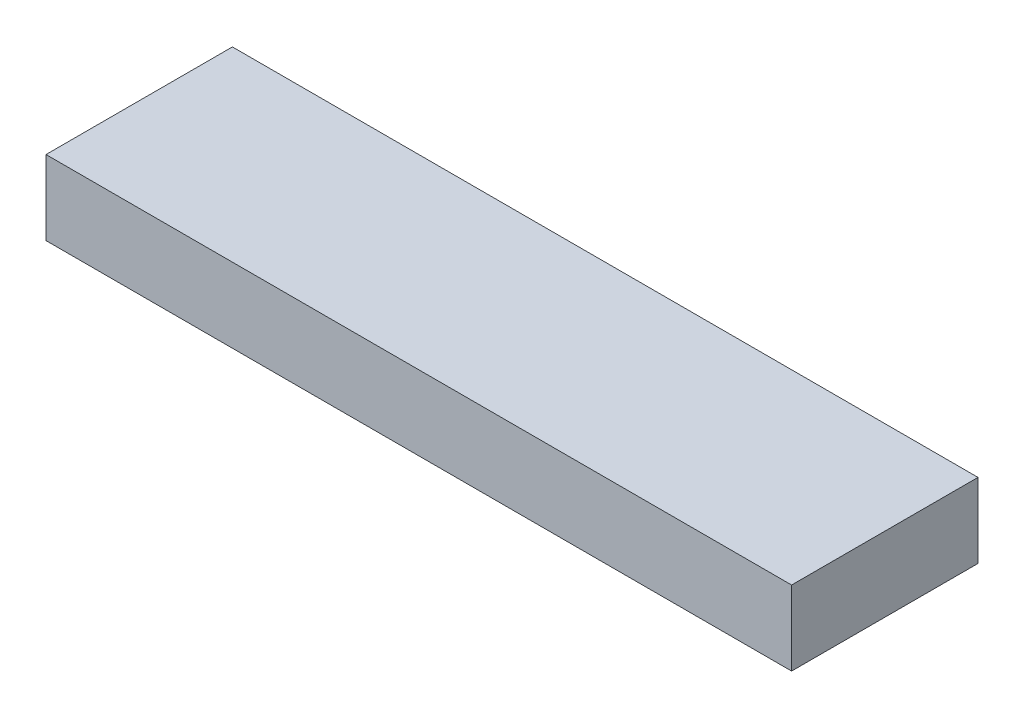
ISO-10303-21;
HEADER;
FILE_DESCRIPTION(('STEP AP214'),'2;1');
FILE_NAME('part.step','',(''),(''),'','','');
FILE_SCHEMA(('AUTOMOTIVE_DESIGN { 1 0 10303 214 1 1 1 1 }'));
ENDSEC;
DATA;
#1=APPLICATION_CONTEXT('core data for automotive mechanical design processes');
#2=APPLICATION_PROTOCOL_DEFINITION('international standard','automotive_design',2000,#1);
#3=PRODUCT_CONTEXT('',#1,'mechanical');
#4=PRODUCT('Part','Part','',(#3));
#5=PRODUCT_RELATED_PRODUCT_CATEGORY('part','',(#4));
#6=PRODUCT_DEFINITION_FORMATION('','',#4);
#7=PRODUCT_DEFINITION_CONTEXT('part definition',#1,'design');
#8=PRODUCT_DEFINITION('design','',#6,#7);
#9=PRODUCT_DEFINITION_SHAPE('','',#8);
#10=(LENGTH_UNIT() NAMED_UNIT(*) SI_UNIT(.MILLI.,.METRE.));
#11=(NAMED_UNIT(*) PLANE_ANGLE_UNIT() SI_UNIT($,.RADIAN.));
#12=(NAMED_UNIT(*) SI_UNIT($,.STERADIAN.) SOLID_ANGLE_UNIT());
#13=UNCERTAINTY_MEASURE_WITH_UNIT(LENGTH_MEASURE(1.E-05),#10,'distance_accuracy_value','');
#14=(GEOMETRIC_REPRESENTATION_CONTEXT(3) GLOBAL_UNCERTAINTY_ASSIGNED_CONTEXT((#13)) GLOBAL_UNIT_ASSIGNED_CONTEXT((#10,
#11,#12)) REPRESENTATION_CONTEXT('',''));
#15=CARTESIAN_POINT('',(0.,0.,0.));
#16=DIRECTION('',(0.,0.,1.));
#17=DIRECTION('',(1.,0.,0.));
#18=AXIS2_PLACEMENT_3D('',#15,#16,#17);
#19=CARTESIAN_POINT('',(-10.,1.,2.5));
#20=DIRECTION('',(0.,0.,-1.));
#21=DIRECTION('',(-1.,0.,0.));
#22=AXIS2_PLACEMENT_3D('',#19,#20,#21);
#23=PLANE('',#22);
#24=DIRECTION('',(0.,-1.,0.));
#25=VECTOR('',#24,1.);
#26=CARTESIAN_POINT('',(-10.,1.,2.5));
#27=LINE('',#26,#25);
#28=CARTESIAN_POINT('',(-10.,1.,2.5));
#29=VERTEX_POINT('',#28);
#30=CARTESIAN_POINT('',(-10.,-1.,2.5));
#31=VERTEX_POINT('',#30);
#32=EDGE_CURVE('E206',#29,#31,#27,.T.);
#33=ORIENTED_EDGE('',*,*,#32,.T.);
#34=DIRECTION('',(1.,0.,0.));
#35=VECTOR('',#34,1.);
#36=CARTESIAN_POINT('',(0.,-1.,2.5));
#37=LINE('',#36,#35);
#38=CARTESIAN_POINT('',(10.,-1.,2.5));
#39=VERTEX_POINT('',#38);
#40=EDGE_CURVE('E175',#31,#39,#37,.T.);
#41=ORIENTED_EDGE('',*,*,#40,.T.);
#42=DIRECTION('',(0.,-1.,0.));
#43=VECTOR('',#42,1.);
#44=CARTESIAN_POINT('',(10.,1.,2.5));
#45=LINE('',#44,#43);
#46=CARTESIAN_POINT('',(10.,1.,2.5));
#47=VERTEX_POINT('',#46);
#48=EDGE_CURVE('E12',#47,#39,#45,.T.);
#49=ORIENTED_EDGE('',*,*,#48,.F.);
#50=DIRECTION('',(1.,0.,0.));
#51=VECTOR('',#50,1.);
#52=CARTESIAN_POINT('',(-10.,1.,2.5));
#53=LINE('',#52,#51);
#54=EDGE_CURVE('E192',#29,#47,#53,.T.);
#55=ORIENTED_EDGE('',*,*,#54,.F.);
#56=EDGE_LOOP('',(#33,#41,#49,#55));
#57=FACE_BOUND('',#56,.T.);
#58=ADVANCED_FACE('F78',(#57),#23,.F.);
#59=CARTESIAN_POINT('',(10.,1.,2.5));
#60=DIRECTION('',(-1.,0.,0.));
#61=DIRECTION('',(0.,0.,1.));
#62=AXIS2_PLACEMENT_3D('',#59,#60,#61);
#63=PLANE('',#62);
#64=ORIENTED_EDGE('',*,*,#48,.T.);
#65=DIRECTION('',(0.,0.,-1.));
#66=VECTOR('',#65,1.);
#67=CARTESIAN_POINT('',(10.,-1.,0.));
#68=LINE('',#67,#66);
#69=CARTESIAN_POINT('',(10.,-1.,-2.5));
#70=VERTEX_POINT('',#69);
#71=EDGE_CURVE('E178',#39,#70,#68,.T.);
#72=ORIENTED_EDGE('',*,*,#71,.T.);
#73=DIRECTION('',(0.,-1.,0.));
#74=VECTOR('',#73,1.);
#75=CARTESIAN_POINT('',(10.,1.,-2.5));
#76=LINE('',#75,#74);
#77=CARTESIAN_POINT('',(10.,1.,-2.5));
#78=VERTEX_POINT('',#77);
#79=EDGE_CURVE('E85',#78,#70,#76,.T.);
#80=ORIENTED_EDGE('',*,*,#79,.F.);
#81=DIRECTION('',(0.,0.,-1.));
#82=VECTOR('',#81,1.);
#83=CARTESIAN_POINT('',(10.,1.,2.5));
#84=LINE('',#83,#82);
#85=EDGE_CURVE('E198',#47,#78,#84,.T.);
#86=ORIENTED_EDGE('',*,*,#85,.F.);
#87=EDGE_LOOP('',(#64,#72,#80,#86));
#88=FACE_BOUND('',#87,.T.);
#89=ADVANCED_FACE('F218',(#88),#63,.F.);
#90=CARTESIAN_POINT('',(-10.,1.,-2.5));
#91=DIRECTION('',(0.,0.,-1.));
#92=DIRECTION('',(-1.,0.,0.));
#93=AXIS2_PLACEMENT_3D('',#90,#91,#92);
#94=PLANE('',#93);
#95=ORIENTED_EDGE('',*,*,#79,.T.);
#96=DIRECTION('',(1.,0.,0.));
#97=VECTOR('',#96,1.);
#98=CARTESIAN_POINT('',(0.,-1.,-2.5));
#99=LINE('',#98,#97);
#100=CARTESIAN_POINT('',(-10.,-1.,-2.5));
#101=VERTEX_POINT('',#100);
#102=EDGE_CURVE('E181',#101,#70,#99,.T.);
#103=ORIENTED_EDGE('',*,*,#102,.F.);
#104=DIRECTION('',(0.,-1.,0.));
#105=VECTOR('',#104,1.);
#106=CARTESIAN_POINT('',(-10.,1.,-2.5));
#107=LINE('',#106,#105);
#108=CARTESIAN_POINT('',(-10.,1.,-2.5));
#109=VERTEX_POINT('',#108);
#110=EDGE_CURVE('E208',#109,#101,#107,.T.);
#111=ORIENTED_EDGE('',*,*,#110,.F.);
#112=DIRECTION('',(1.,0.,0.));
#113=VECTOR('',#112,1.);
#114=CARTESIAN_POINT('',(-10.,1.,-2.5));
#115=LINE('',#114,#113);
#116=EDGE_CURVE('E200',#109,#78,#115,.T.);
#117=ORIENTED_EDGE('',*,*,#116,.T.);
#118=EDGE_LOOP('',(#95,#103,#111,#117));
#119=FACE_BOUND('',#118,.T.);
#120=ADVANCED_FACE('F212',(#119),#94,.T.);
#121=CARTESIAN_POINT('',(-10.,1.,2.5));
#122=DIRECTION('',(-1.,0.,0.));
#123=DIRECTION('',(0.,0.,1.));
#124=AXIS2_PLACEMENT_3D('',#121,#122,#123);
#125=PLANE('',#124);
#126=ORIENTED_EDGE('',*,*,#110,.T.);
#127=DIRECTION('',(0.,0.,-1.));
#128=VECTOR('',#127,1.);
#129=CARTESIAN_POINT('',(-10.,-1.,0.));
#130=LINE('',#129,#128);
#131=EDGE_CURVE('E161',#31,#101,#130,.T.);
#132=ORIENTED_EDGE('',*,*,#131,.F.);
#133=ORIENTED_EDGE('',*,*,#32,.F.);
#134=DIRECTION('',(0.,0.,-1.));
#135=VECTOR('',#134,1.);
#136=CARTESIAN_POINT('',(-10.,1.,2.5));
#137=LINE('',#136,#135);
#138=EDGE_CURVE('E203',#29,#109,#137,.T.);
#139=ORIENTED_EDGE('',*,*,#138,.T.);
#140=EDGE_LOOP('',(#126,#132,#133,#139));
#141=FACE_BOUND('',#140,.T.);
#142=ADVANCED_FACE('F224',(#141),#125,.T.);
#143=CARTESIAN_POINT('',(0.,1.,0.));
#144=DIRECTION('',(0.,1.,0.));
#145=DIRECTION('',(0.,0.,1.));
#146=AXIS2_PLACEMENT_3D('',#143,#144,#145);
#147=PLANE('',#146);
#148=ORIENTED_EDGE('',*,*,#54,.T.);
#149=ORIENTED_EDGE('',*,*,#85,.T.);
#150=ORIENTED_EDGE('',*,*,#116,.F.);
#151=ORIENTED_EDGE('',*,*,#138,.F.);
#152=EDGE_LOOP('',(#148,#149,#150,#151));
#153=FACE_BOUND('',#152,.T.);
#154=ADVANCED_FACE('F226',(#153),#147,.T.);
#155=CARTESIAN_POINT('',(9.,-1.,0.));
#156=DIRECTION('',(1.,0.,0.));
#157=DIRECTION('',(0.,0.,-1.));
#158=AXIS2_PLACEMENT_3D('',#155,#156,#157);
#159=PLANE('',#158);
#160=DIRECTION('',(0.,0.,-1.));
#161=VECTOR('',#160,1.);
#162=CARTESIAN_POINT('',(9.,0.,0.));
#163=LINE('',#162,#161);
#164=CARTESIAN_POINT('',(9.,0.,1.5));
#165=VERTEX_POINT('',#164);
#166=CARTESIAN_POINT('',(9.,0.,-1.5));
#167=VERTEX_POINT('',#166);
#168=EDGE_CURVE('E186',#165,#167,#163,.T.);
#169=ORIENTED_EDGE('',*,*,#168,.T.);
#170=DIRECTION('',(0.,1.,0.));
#171=VECTOR('',#170,1.);
#172=CARTESIAN_POINT('',(9.,-1.,-1.5));
#173=LINE('',#172,#171);
#174=CARTESIAN_POINT('',(9.,-1.,-1.5));
#175=VERTEX_POINT('',#174);
#176=EDGE_CURVE('E164',#175,#167,#173,.T.);
#177=ORIENTED_EDGE('',*,*,#176,.F.);
#178=DIRECTION('',(0.,0.,-1.));
#179=VECTOR('',#178,1.);
#180=CARTESIAN_POINT('',(9.,-1.,0.));
#181=LINE('',#180,#179);
#182=CARTESIAN_POINT('',(9.,-1.,1.5));
#183=VERTEX_POINT('',#182);
#184=EDGE_CURVE('E146',#183,#175,#181,.T.);
#185=ORIENTED_EDGE('',*,*,#184,.F.);
#186=DIRECTION('',(0.,1.,0.));
#187=VECTOR('',#186,1.);
#188=CARTESIAN_POINT('',(9.,-1.,1.5));
#189=LINE('',#188,#187);
#190=EDGE_CURVE('E155',#183,#165,#189,.T.);
#191=ORIENTED_EDGE('',*,*,#190,.T.);
#192=EDGE_LOOP('',(#169,#177,#185,#191));
#193=FACE_BOUND('',#192,.T.);
#194=ADVANCED_FACE('F163',(#193),#159,.F.);
#195=CARTESIAN_POINT('',(0.,-1.,-1.5));
#196=DIRECTION('',(0.,0.,1.));
#197=DIRECTION('',(1.,0.,0.));
#198=AXIS2_PLACEMENT_3D('',#195,#196,#197);
#199=PLANE('',#198);
#200=DIRECTION('',(1.,0.,0.));
#201=VECTOR('',#200,1.);
#202=CARTESIAN_POINT('',(0.,0.,-1.5));
#203=LINE('',#202,#201);
#204=CARTESIAN_POINT('',(-9.,0.,-1.5));
#205=VERTEX_POINT('',#204);
#206=EDGE_CURVE('E92',#205,#167,#203,.T.);
#207=ORIENTED_EDGE('',*,*,#206,.F.);
#208=DIRECTION('',(0.,1.,0.));
#209=VECTOR('',#208,1.);
#210=CARTESIAN_POINT('',(-9.,-1.,-1.5));
#211=LINE('',#210,#209);
#212=CARTESIAN_POINT('',(-9.,-1.,-1.5));
#213=VERTEX_POINT('',#212);
#214=EDGE_CURVE('E193',#213,#205,#211,.T.);
#215=ORIENTED_EDGE('',*,*,#214,.F.);
#216=DIRECTION('',(1.,0.,0.));
#217=VECTOR('',#216,1.);
#218=CARTESIAN_POINT('',(0.,-1.,-1.5));
#219=LINE('',#218,#217);
#220=EDGE_CURVE('E173',#213,#175,#219,.T.);
#221=ORIENTED_EDGE('',*,*,#220,.T.);
#222=ORIENTED_EDGE('',*,*,#176,.T.);
#223=EDGE_LOOP('',(#207,#215,#221,#222));
#224=FACE_BOUND('',#223,.T.);
#225=ADVANCED_FACE('F233',(#224),#199,.T.);
#226=CARTESIAN_POINT('',(-9.,-1.,0.));
#227=DIRECTION('',(1.,0.,0.));
#228=DIRECTION('',(0.,0.,-1.));
#229=AXIS2_PLACEMENT_3D('',#226,#227,#228);
#230=PLANE('',#229);
#231=DIRECTION('',(0.,0.,-1.));
#232=VECTOR('',#231,1.);
#233=CARTESIAN_POINT('',(-9.,0.,0.));
#234=LINE('',#233,#232);
#235=CARTESIAN_POINT('',(-9.,0.,1.5));
#236=VERTEX_POINT('',#235);
#237=EDGE_CURVE('E97',#236,#205,#234,.T.);
#238=ORIENTED_EDGE('',*,*,#237,.F.);
#239=DIRECTION('',(0.,1.,0.));
#240=VECTOR('',#239,1.);
#241=CARTESIAN_POINT('',(-9.,-1.,1.5));
#242=LINE('',#241,#240);
#243=CARTESIAN_POINT('',(-9.,-1.,1.5));
#244=VERTEX_POINT('',#243);
#245=EDGE_CURVE('E160',#244,#236,#242,.T.);
#246=ORIENTED_EDGE('',*,*,#245,.F.);
#247=DIRECTION('',(0.,0.,-1.));
#248=VECTOR('',#247,1.);
#249=CARTESIAN_POINT('',(-9.,-1.,0.));
#250=LINE('',#249,#248);
#251=EDGE_CURVE('E149',#244,#213,#250,.T.);
#252=ORIENTED_EDGE('',*,*,#251,.T.);
#253=ORIENTED_EDGE('',*,*,#214,.T.);
#254=EDGE_LOOP('',(#238,#246,#252,#253));
#255=FACE_BOUND('',#254,.T.);
#256=ADVANCED_FACE('F268',(#255),#230,.T.);
#257=CARTESIAN_POINT('',(0.,-1.,1.5));
#258=DIRECTION('',(0.,0.,1.));
#259=DIRECTION('',(1.,0.,0.));
#260=AXIS2_PLACEMENT_3D('',#257,#258,#259);
#261=PLANE('',#260);
#262=DIRECTION('',(1.,0.,0.));
#263=VECTOR('',#262,1.);
#264=CARTESIAN_POINT('',(0.,0.,1.5));
#265=LINE('',#264,#263);
#266=EDGE_CURVE('E157',#236,#165,#265,.T.);
#267=ORIENTED_EDGE('',*,*,#266,.T.);
#268=ORIENTED_EDGE('',*,*,#190,.F.);
#269=DIRECTION('',(1.,0.,0.));
#270=VECTOR('',#269,1.);
#271=CARTESIAN_POINT('',(0.,-1.,1.5));
#272=LINE('',#271,#270);
#273=EDGE_CURVE('E140',#244,#183,#272,.T.);
#274=ORIENTED_EDGE('',*,*,#273,.F.);
#275=ORIENTED_EDGE('',*,*,#245,.T.);
#276=EDGE_LOOP('',(#267,#268,#274,#275));
#277=FACE_BOUND('',#276,.T.);
#278=ADVANCED_FACE('F156',(#277),#261,.F.);
#279=CARTESIAN_POINT('',(0.,-1.,0.));
#280=DIRECTION('',(0.,1.,0.));
#281=DIRECTION('',(0.,0.,1.));
#282=AXIS2_PLACEMENT_3D('',#279,#280,#281);
#283=PLANE('',#282);
#284=ORIENTED_EDGE('',*,*,#184,.T.);
#285=ORIENTED_EDGE('',*,*,#220,.F.);
#286=ORIENTED_EDGE('',*,*,#251,.F.);
#287=ORIENTED_EDGE('',*,*,#273,.T.);
#288=EDGE_LOOP('',(#284,#285,#286,#287));
#289=FACE_BOUND('',#288,.T.);
#290=ORIENTED_EDGE('',*,*,#40,.F.);
#291=ORIENTED_EDGE('',*,*,#131,.T.);
#292=ORIENTED_EDGE('',*,*,#102,.T.);
#293=ORIENTED_EDGE('',*,*,#71,.F.);
#294=EDGE_LOOP('',(#290,#291,#292,#293));
#295=FACE_BOUND('',#294,.T.);
#296=ADVANCED_FACE('F142',(#289,#295),#283,.F.);
#297=CARTESIAN_POINT('',(0.,0.,0.));
#298=DIRECTION('',(0.,1.,0.));
#299=DIRECTION('',(0.,0.,1.));
#300=AXIS2_PLACEMENT_3D('',#297,#298,#299);
#301=PLANE('',#300);
#302=CARTESIAN_POINT('',(5.,0.,0.));
#303=DIRECTION('',(0.,1.,0.));
#304=DIRECTION('',(0.,0.,1.));
#305=AXIS2_PLACEMENT_3D('',#302,#303,#304);
#306=CIRCLE('',#305,0.999999999999999);
#307=CARTESIAN_POINT('',(5.,0.,0.999999999999999));
#308=VERTEX_POINT('',#307);
#309=EDGE_CURVE('E260',#308,#308,#306,.T.);
#310=ORIENTED_EDGE('',*,*,#309,.T.);
#311=EDGE_LOOP('',(#310));
#312=FACE_BOUND('',#311,.T.);
#313=CARTESIAN_POINT('',(0.,0.,0.));
#314=DIRECTION('',(0.,1.,0.));
#315=DIRECTION('',(0.,0.,1.));
#316=AXIS2_PLACEMENT_3D('',#313,#314,#315);
#317=CIRCLE('',#316,0.999999999999999);
#318=CARTESIAN_POINT('',(0.,0.,0.999999999999999));
#319=VERTEX_POINT('',#318);
#320=EDGE_CURVE('E264',#319,#319,#317,.T.);
#321=ORIENTED_EDGE('',*,*,#320,.T.);
#322=EDGE_LOOP('',(#321));
#323=FACE_BOUND('',#322,.T.);
#324=CARTESIAN_POINT('',(-5.,0.,0.));
#325=DIRECTION('',(0.,1.,0.));
#326=DIRECTION('',(0.,0.,1.));
#327=AXIS2_PLACEMENT_3D('',#324,#325,#326);
#328=CIRCLE('',#327,0.999999999999999);
#329=CARTESIAN_POINT('',(-5.,0.,1.00000000000003));
#330=VERTEX_POINT('',#329);
#331=EDGE_CURVE('E169',#330,#330,#328,.T.);
#332=ORIENTED_EDGE('',*,*,#331,.T.);
#333=EDGE_LOOP('',(#332));
#334=FACE_BOUND('',#333,.T.);
#335=ORIENTED_EDGE('',*,*,#168,.F.);
#336=ORIENTED_EDGE('',*,*,#266,.F.);
#337=ORIENTED_EDGE('',*,*,#237,.T.);
#338=ORIENTED_EDGE('',*,*,#206,.T.);
#339=EDGE_LOOP('',(#335,#336,#337,#338));
#340=FACE_BOUND('',#339,.T.);
#341=ADVANCED_FACE('F245',(#312,#323,#334,#340),#301,.F.);
#342=CARTESIAN_POINT('',(-5.,-1.,0.));
#343=DIRECTION('',(0.,1.,0.));
#344=DIRECTION('',(0.,0.,1.));
#345=AXIS2_PLACEMENT_3D('',#342,#343,#344);
#346=CYLINDRICAL_SURFACE('',#345,0.999999999999999);
#347=CARTESIAN_POINT('',(-5.,-1.,0.));
#348=DIRECTION('',(0.,1.,0.));
#349=DIRECTION('',(0.,0.,1.));
#350=AXIS2_PLACEMENT_3D('',#347,#348,#349);
#351=CIRCLE('',#350,0.999999999999999);
#352=CARTESIAN_POINT('',(-5.,-1.,1.00000000000003));
#353=VERTEX_POINT('',#352);
#354=EDGE_CURVE('E188',#353,#353,#351,.T.);
#355=ORIENTED_EDGE('',*,*,#354,.T.);
#356=EDGE_LOOP('',(#355));
#357=FACE_BOUND('',#356,.T.);
#358=ORIENTED_EDGE('',*,*,#331,.F.);
#359=EDGE_LOOP('',(#358));
#360=FACE_BOUND('',#359,.T.);
#361=ADVANCED_FACE('F247',(#357,#360),#346,.T.);
#362=CARTESIAN_POINT('',(0.,-1.,0.));
#363=DIRECTION('',(0.,1.,0.));
#364=DIRECTION('',(0.,0.,1.));
#365=AXIS2_PLACEMENT_3D('',#362,#363,#364);
#366=PLANE('',#365);
#367=ORIENTED_EDGE('',*,*,#354,.F.);
#368=EDGE_LOOP('',(#367));
#369=FACE_BOUND('',#368,.T.);
#370=ADVANCED_FACE('F253',(#369),#366,.F.);
#371=CARTESIAN_POINT('',(0.,-1.,0.));
#372=DIRECTION('',(0.,1.,0.));
#373=DIRECTION('',(0.,0.,1.));
#374=AXIS2_PLACEMENT_3D('',#371,#372,#373);
#375=CYLINDRICAL_SURFACE('',#374,0.999999999999999);
#376=CARTESIAN_POINT('',(0.,-1.,0.));
#377=DIRECTION('',(0.,1.,0.));
#378=DIRECTION('',(0.,0.,1.));
#379=AXIS2_PLACEMENT_3D('',#376,#377,#378);
#380=CIRCLE('',#379,0.999999999999999);
#381=CARTESIAN_POINT('',(0.,-1.,0.999999999999999));
#382=VERTEX_POINT('',#381);
#383=EDGE_CURVE('E355',#382,#382,#380,.T.);
#384=ORIENTED_EDGE('',*,*,#383,.T.);
#385=EDGE_LOOP('',(#384));
#386=FACE_BOUND('',#385,.T.);
#387=ORIENTED_EDGE('',*,*,#320,.F.);
#388=EDGE_LOOP('',(#387));
#389=FACE_BOUND('',#388,.T.);
#390=ADVANCED_FACE('F307',(#386,#389),#375,.T.);
#391=CARTESIAN_POINT('',(0.,-1.,0.));
#392=DIRECTION('',(0.,1.,0.));
#393=DIRECTION('',(0.,0.,1.));
#394=AXIS2_PLACEMENT_3D('',#391,#392,#393);
#395=PLANE('',#394);
#396=ORIENTED_EDGE('',*,*,#383,.F.);
#397=EDGE_LOOP('',(#396));
#398=FACE_BOUND('',#397,.T.);
#399=ADVANCED_FACE('F317',(#398),#395,.F.);
#400=CARTESIAN_POINT('',(5.,-1.,0.));
#401=DIRECTION('',(0.,1.,0.));
#402=DIRECTION('',(0.,0.,1.));
#403=AXIS2_PLACEMENT_3D('',#400,#401,#402);
#404=CYLINDRICAL_SURFACE('',#403,0.999999999999999);
#405=CARTESIAN_POINT('',(5.,-1.,0.));
#406=DIRECTION('',(0.,1.,0.));
#407=DIRECTION('',(0.,0.,1.));
#408=AXIS2_PLACEMENT_3D('',#405,#406,#407);
#409=CIRCLE('',#408,0.999999999999999);
#410=CARTESIAN_POINT('',(5.,-1.,0.999999999999999));
#411=VERTEX_POINT('',#410);
#412=EDGE_CURVE('E353',#411,#411,#409,.T.);
#413=ORIENTED_EDGE('',*,*,#412,.T.);
#414=EDGE_LOOP('',(#413));
#415=FACE_BOUND('',#414,.T.);
#416=ORIENTED_EDGE('',*,*,#309,.F.);
#417=EDGE_LOOP('',(#416));
#418=FACE_BOUND('',#417,.T.);
#419=ADVANCED_FACE('F327',(#415,#418),#404,.T.);
#420=CARTESIAN_POINT('',(0.,-1.,0.));
#421=DIRECTION('',(0.,1.,0.));
#422=DIRECTION('',(0.,0.,1.));
#423=AXIS2_PLACEMENT_3D('',#420,#421,#422);
#424=PLANE('',#423);
#425=ORIENTED_EDGE('',*,*,#412,.F.);
#426=EDGE_LOOP('',(#425));
#427=FACE_BOUND('',#426,.T.);
#428=ADVANCED_FACE('F337',(#427),#424,.F.);
#429=CLOSED_SHELL('',(#58,#89,#120,#142,#154,#194,#225,#256,#278,#296,#341,#361,#370,#390,#399,
#419,#428));
#430=MANIFOLD_SOLID_BREP('B2',#429);
#431=ADVANCED_BREP_SHAPE_REPRESENTATION('',(#18,#430),#14);
#432=SHAPE_DEFINITION_REPRESENTATION(#9,#431);
ENDSEC;
END-ISO-10303-21;
